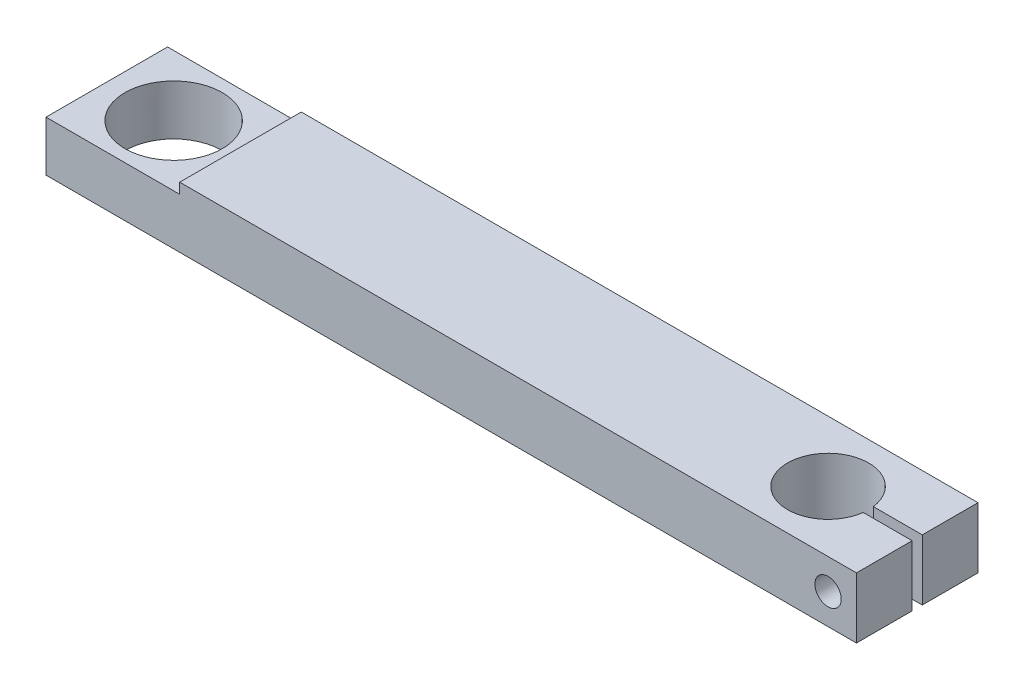
ISO-10303-21;
HEADER;
FILE_DESCRIPTION(('STEP AP214'),'2;1');
FILE_NAME('part.step','',(''),(''),'','','');
FILE_SCHEMA(('AUTOMOTIVE_DESIGN { 1 0 10303 214 1 1 1 1 }'));
ENDSEC;
DATA;
#1=APPLICATION_CONTEXT('core data for automotive mechanical design processes');
#2=APPLICATION_PROTOCOL_DEFINITION('international standard','automotive_design',2000,#1);
#3=PRODUCT_CONTEXT('',#1,'mechanical');
#4=PRODUCT('Part','Part','',(#3));
#5=PRODUCT_RELATED_PRODUCT_CATEGORY('part','',(#4));
#6=PRODUCT_DEFINITION_FORMATION('','',#4);
#7=PRODUCT_DEFINITION_CONTEXT('part definition',#1,'design');
#8=PRODUCT_DEFINITION('design','',#6,#7);
#9=PRODUCT_DEFINITION_SHAPE('','',#8);
#10=(LENGTH_UNIT() NAMED_UNIT(*) SI_UNIT(.MILLI.,.METRE.));
#11=(NAMED_UNIT(*) PLANE_ANGLE_UNIT() SI_UNIT($,.RADIAN.));
#12=(NAMED_UNIT(*) SI_UNIT($,.STERADIAN.) SOLID_ANGLE_UNIT());
#13=UNCERTAINTY_MEASURE_WITH_UNIT(LENGTH_MEASURE(1.E-05),#10,'distance_accuracy_value','');
#14=(GEOMETRIC_REPRESENTATION_CONTEXT(3) GLOBAL_UNCERTAINTY_ASSIGNED_CONTEXT((#13)) GLOBAL_UNIT_ASSIGNED_CONTEXT((#10,
#11,#12)) REPRESENTATION_CONTEXT('',''));
#15=CARTESIAN_POINT('',(0.,0.,0.));
#16=DIRECTION('',(0.,0.,1.));
#17=DIRECTION('',(1.,0.,0.));
#18=AXIS2_PLACEMENT_3D('',#15,#16,#17);
#19=CARTESIAN_POINT('',(78.,15.,0.));
#20=DIRECTION('',(0.,-1.,0.));
#21=DIRECTION('',(0.,0.,-1.));
#22=AXIS2_PLACEMENT_3D('',#19,#20,#21);
#23=CYLINDRICAL_SURFACE('',#22,9.99999999999999);
#24=CARTESIAN_POINT('',(78.,0.,0.));
#25=DIRECTION('',(0.,1.,0.));
#26=DIRECTION('',(0.,0.,1.));
#27=AXIS2_PLACEMENT_3D('',#24,#25,#26);
#28=CIRCLE('',#27,9.99999999999999);
#29=CARTESIAN_POINT('',(87.9215674164922,0.,-1.25));
#30=VERTEX_POINT('',#29);
#31=CARTESIAN_POINT('',(87.9215674164922,0.,1.25));
#32=VERTEX_POINT('',#31);
#33=EDGE_CURVE('E168',#30,#32,#28,.T.);
#34=ORIENTED_EDGE('',*,*,#33,.F.);
#35=DIRECTION('',(0.,-1.,0.));
#36=VECTOR('',#35,1.);
#37=CARTESIAN_POINT('',(87.9215674164922,15.,-1.25));
#38=LINE('',#37,#36);
#39=CARTESIAN_POINT('',(87.9215674164922,15.,-1.25));
#40=VERTEX_POINT('',#39);
#41=EDGE_CURVE('E11',#40,#30,#38,.T.);
#42=ORIENTED_EDGE('',*,*,#41,.F.);
#43=CARTESIAN_POINT('',(78.,15.,0.));
#44=DIRECTION('',(0.,1.,0.));
#45=DIRECTION('',(0.,0.,1.));
#46=AXIS2_PLACEMENT_3D('',#43,#44,#45);
#47=CIRCLE('',#46,9.99999999999999);
#48=CARTESIAN_POINT('',(87.9215674164922,15.,1.25));
#49=VERTEX_POINT('',#48);
#50=EDGE_CURVE('E153',#40,#49,#47,.T.);
#51=ORIENTED_EDGE('',*,*,#50,.T.);
#52=DIRECTION('',(0.,-1.,0.));
#53=VECTOR('',#52,1.);
#54=CARTESIAN_POINT('',(87.9215674164922,15.,1.25));
#55=LINE('',#54,#53);
#56=EDGE_CURVE('E98',#49,#32,#55,.T.);
#57=ORIENTED_EDGE('',*,*,#56,.T.);
#58=EDGE_LOOP('',(#34,#42,#51,#57));
#59=FACE_BOUND('',#58,.T.);
#60=ADVANCED_FACE('F39',(#59),#23,.F.);
#61=CARTESIAN_POINT('',(0.,15.,-1.25));
#62=DIRECTION('',(0.,0.,-1.));
#63=DIRECTION('',(-1.,0.,0.));
#64=AXIS2_PLACEMENT_3D('',#61,#62,#63);
#65=PLANE('',#64);
#66=CARTESIAN_POINT('',(93.,7.5,-1.25));
#67=DIRECTION('',(0.,0.,-1.));
#68=DIRECTION('',(-1.,0.,0.));
#69=AXIS2_PLACEMENT_3D('',#66,#67,#68);
#70=CIRCLE('',#69,3.25000000000001);
#71=CARTESIAN_POINT('',(89.75,7.5,-1.25));
#72=VERTEX_POINT('',#71);
#73=EDGE_CURVE('E164',#72,#72,#70,.T.);
#74=ORIENTED_EDGE('',*,*,#73,.T.);
#75=EDGE_LOOP('',(#74));
#76=FACE_BOUND('',#75,.T.);
#77=DIRECTION('',(1.,0.,0.));
#78=VECTOR('',#77,1.);
#79=CARTESIAN_POINT('',(0.,0.,-1.25));
#80=LINE('',#79,#78);
#81=CARTESIAN_POINT('',(100.,0.,-1.25));
#82=VERTEX_POINT('',#81);
#83=EDGE_CURVE('E273',#30,#82,#80,.T.);
#84=ORIENTED_EDGE('',*,*,#83,.T.);
#85=DIRECTION('',(0.,-1.,0.));
#86=VECTOR('',#85,1.);
#87=CARTESIAN_POINT('',(100.,15.,-1.25));
#88=LINE('',#87,#86);
#89=CARTESIAN_POINT('',(100.,15.,-1.25));
#90=VERTEX_POINT('',#89);
#91=EDGE_CURVE('E48',#90,#82,#88,.T.);
#92=ORIENTED_EDGE('',*,*,#91,.F.);
#93=DIRECTION('',(1.,0.,0.));
#94=VECTOR('',#93,1.);
#95=CARTESIAN_POINT('',(0.,15.,-1.25));
#96=LINE('',#95,#94);
#97=EDGE_CURVE('E147',#40,#90,#96,.T.);
#98=ORIENTED_EDGE('',*,*,#97,.F.);
#99=ORIENTED_EDGE('',*,*,#41,.T.);
#100=EDGE_LOOP('',(#84,#92,#98,#99));
#101=FACE_BOUND('',#100,.T.);
#102=ADVANCED_FACE('F262',(#76,#101),#65,.F.);
#103=CARTESIAN_POINT('',(100.,15.,0.));
#104=DIRECTION('',(1.,0.,0.));
#105=DIRECTION('',(0.,0.,-1.));
#106=AXIS2_PLACEMENT_3D('',#103,#104,#105);
#107=PLANE('',#106);
#108=DIRECTION('',(0.,0.,1.));
#109=VECTOR('',#108,1.);
#110=CARTESIAN_POINT('',(100.,0.,0.));
#111=LINE('',#110,#109);
#112=CARTESIAN_POINT('',(100.,0.,-15.));
#113=VERTEX_POINT('',#112);
#114=EDGE_CURVE('E277',#113,#82,#111,.T.);
#115=ORIENTED_EDGE('',*,*,#114,.F.);
#116=DIRECTION('',(0.,-1.,0.));
#117=VECTOR('',#116,1.);
#118=CARTESIAN_POINT('',(100.,15.,-15.));
#119=LINE('',#118,#117);
#120=CARTESIAN_POINT('',(100.,15.,-15.));
#121=VERTEX_POINT('',#120);
#122=EDGE_CURVE('E230',#121,#113,#119,.T.);
#123=ORIENTED_EDGE('',*,*,#122,.F.);
#124=DIRECTION('',(0.,0.,1.));
#125=VECTOR('',#124,1.);
#126=CARTESIAN_POINT('',(100.,15.,0.));
#127=LINE('',#126,#125);
#128=EDGE_CURVE('E140',#121,#90,#127,.T.);
#129=ORIENTED_EDGE('',*,*,#128,.T.);
#130=ORIENTED_EDGE('',*,*,#91,.T.);
#131=EDGE_LOOP('',(#115,#123,#129,#130));
#132=FACE_BOUND('',#131,.T.);
#133=ADVANCED_FACE('F266',(#132),#107,.T.);
#134=CARTESIAN_POINT('',(0.,15.,-15.));
#135=DIRECTION('',(0.,0.,-1.));
#136=DIRECTION('',(-1.,0.,0.));
#137=AXIS2_PLACEMENT_3D('',#134,#135,#136);
#138=PLANE('',#137);
#139=DIRECTION('',(-1.,0.,0.));
#140=VECTOR('',#139,1.);
#141=CARTESIAN_POINT('',(-100.,12.4,-15.));
#142=LINE('',#141,#140);
#143=CARTESIAN_POINT('',(-67.,12.4,-15.));
#144=VERTEX_POINT('',#143);
#145=CARTESIAN_POINT('',(-100.,12.4,-15.));
#146=VERTEX_POINT('',#145);
#147=EDGE_CURVE('E192',#144,#146,#142,.T.);
#148=ORIENTED_EDGE('',*,*,#147,.F.);
#149=DIRECTION('',(0.,-1.,0.));
#150=VECTOR('',#149,1.);
#151=CARTESIAN_POINT('',(-67.,12.4,-15.));
#152=LINE('',#151,#150);
#153=CARTESIAN_POINT('',(-67.,15.,-15.));
#154=VERTEX_POINT('',#153);
#155=EDGE_CURVE('E196',#154,#144,#152,.T.);
#156=ORIENTED_EDGE('',*,*,#155,.F.);
#157=DIRECTION('',(1.,0.,0.));
#158=VECTOR('',#157,1.);
#159=CARTESIAN_POINT('',(0.,15.,-15.));
#160=LINE('',#159,#158);
#161=EDGE_CURVE('E123',#154,#121,#160,.T.);
#162=ORIENTED_EDGE('',*,*,#161,.T.);
#163=ORIENTED_EDGE('',*,*,#122,.T.);
#164=DIRECTION('',(1.,0.,0.));
#165=VECTOR('',#164,1.);
#166=CARTESIAN_POINT('',(0.,0.,-15.));
#167=LINE('',#166,#165);
#168=CARTESIAN_POINT('',(-100.,0.,-15.));
#169=VERTEX_POINT('',#168);
#170=EDGE_CURVE('E225',#169,#113,#167,.T.);
#171=ORIENTED_EDGE('',*,*,#170,.F.);
#172=DIRECTION('',(0.,-1.,0.));
#173=VECTOR('',#172,1.);
#174=CARTESIAN_POINT('',(-100.,15.,-15.));
#175=LINE('',#174,#173);
#176=EDGE_CURVE('E223',#146,#169,#175,.T.);
#177=ORIENTED_EDGE('',*,*,#176,.F.);
#178=EDGE_LOOP('',(#148,#156,#162,#163,#171,#177));
#179=FACE_BOUND('',#178,.T.);
#180=CARTESIAN_POINT('',(93.,7.5,-15.));
#181=DIRECTION('',(0.,0.,-1.));
#182=DIRECTION('',(-1.,0.,0.));
#183=AXIS2_PLACEMENT_3D('',#180,#181,#182);
#184=CIRCLE('',#183,5.25);
#185=CARTESIAN_POINT('',(87.75,7.5,-15.));
#186=VERTEX_POINT('',#185);
#187=EDGE_CURVE('E159',#186,#186,#184,.T.);
#188=ORIENTED_EDGE('',*,*,#187,.F.);
#189=EDGE_LOOP('',(#188));
#190=FACE_BOUND('',#189,.T.);
#191=ADVANCED_FACE('F220',(#179,#190),#138,.T.);
#192=CARTESIAN_POINT('',(-100.,15.,0.));
#193=DIRECTION('',(1.,0.,0.));
#194=DIRECTION('',(0.,0.,-1.));
#195=AXIS2_PLACEMENT_3D('',#192,#193,#194);
#196=PLANE('',#195);
#197=DIRECTION('',(0.,-1.,0.));
#198=VECTOR('',#197,1.);
#199=CARTESIAN_POINT('',(-100.,15.,15.));
#200=LINE('',#199,#198);
#201=CARTESIAN_POINT('',(-100.,12.4,15.));
#202=VERTEX_POINT('',#201);
#203=CARTESIAN_POINT('',(-100.,0.,15.));
#204=VERTEX_POINT('',#203);
#205=EDGE_CURVE('E134',#202,#204,#200,.T.);
#206=ORIENTED_EDGE('',*,*,#205,.F.);
#207=DIRECTION('',(0.,0.,-1.));
#208=VECTOR('',#207,1.);
#209=CARTESIAN_POINT('',(-100.,12.4,15.));
#210=LINE('',#209,#208);
#211=EDGE_CURVE('E188',#202,#146,#210,.T.);
#212=ORIENTED_EDGE('',*,*,#211,.T.);
#213=ORIENTED_EDGE('',*,*,#176,.T.);
#214=DIRECTION('',(0.,0.,1.));
#215=VECTOR('',#214,1.);
#216=CARTESIAN_POINT('',(-100.,0.,0.));
#217=LINE('',#216,#215);
#218=EDGE_CURVE('E286',#169,#204,#217,.T.);
#219=ORIENTED_EDGE('',*,*,#218,.T.);
#220=EDGE_LOOP('',(#206,#212,#213,#219));
#221=FACE_BOUND('',#220,.T.);
#222=ADVANCED_FACE('F303',(#221),#196,.F.);
#223=CARTESIAN_POINT('',(0.,15.,15.));
#224=DIRECTION('',(0.,0.,-1.));
#225=DIRECTION('',(-1.,0.,0.));
#226=AXIS2_PLACEMENT_3D('',#223,#224,#225);
#227=PLANE('',#226);
#228=CARTESIAN_POINT('',(93.,7.5,15.));
#229=DIRECTION('',(0.,0.,-1.));
#230=DIRECTION('',(-1.,0.,0.));
#231=AXIS2_PLACEMENT_3D('',#228,#229,#230);
#232=CIRCLE('',#231,3.25000000000001);
#233=CARTESIAN_POINT('',(89.75,7.5,15.));
#234=VERTEX_POINT('',#233);
#235=EDGE_CURVE('E177',#234,#234,#232,.T.);
#236=ORIENTED_EDGE('',*,*,#235,.T.);
#237=EDGE_LOOP('',(#236));
#238=FACE_BOUND('',#237,.T.);
#239=DIRECTION('',(0.,-1.,0.));
#240=VECTOR('',#239,1.);
#241=CARTESIAN_POINT('',(-67.,12.4,15.));
#242=LINE('',#241,#240);
#243=CARTESIAN_POINT('',(-67.,15.,15.));
#244=VERTEX_POINT('',#243);
#245=CARTESIAN_POINT('',(-67.,12.4,15.));
#246=VERTEX_POINT('',#245);
#247=EDGE_CURVE('E56',#244,#246,#242,.T.);
#248=ORIENTED_EDGE('',*,*,#247,.T.);
#249=DIRECTION('',(-1.,0.,0.));
#250=VECTOR('',#249,1.);
#251=CARTESIAN_POINT('',(-100.,12.4,15.));
#252=LINE('',#251,#250);
#253=EDGE_CURVE('E184',#246,#202,#252,.T.);
#254=ORIENTED_EDGE('',*,*,#253,.T.);
#255=ORIENTED_EDGE('',*,*,#205,.T.);
#256=DIRECTION('',(1.,0.,0.));
#257=VECTOR('',#256,1.);
#258=CARTESIAN_POINT('',(0.,0.,15.));
#259=LINE('',#258,#257);
#260=CARTESIAN_POINT('',(100.,0.,15.));
#261=VERTEX_POINT('',#260);
#262=EDGE_CURVE('E129',#204,#261,#259,.T.);
#263=ORIENTED_EDGE('',*,*,#262,.T.);
#264=DIRECTION('',(0.,-1.,0.));
#265=VECTOR('',#264,1.);
#266=CARTESIAN_POINT('',(100.,15.,15.));
#267=LINE('',#266,#265);
#268=CARTESIAN_POINT('',(100.,15.,15.));
#269=VERTEX_POINT('',#268);
#270=EDGE_CURVE('E126',#269,#261,#267,.T.);
#271=ORIENTED_EDGE('',*,*,#270,.F.);
#272=DIRECTION('',(1.,0.,0.));
#273=VECTOR('',#272,1.);
#274=CARTESIAN_POINT('',(0.,15.,15.));
#275=LINE('',#274,#273);
#276=EDGE_CURVE('E114',#244,#269,#275,.T.);
#277=ORIENTED_EDGE('',*,*,#276,.F.);
#278=EDGE_LOOP('',(#248,#254,#255,#263,#271,#277));
#279=FACE_BOUND('',#278,.T.);
#280=ADVANCED_FACE('F127',(#238,#279),#227,.F.);
#281=CARTESIAN_POINT('',(100.,0.,1.25));
#282=VERTEX_POINT('',#281);
#283=EDGE_CURVE('E283',#282,#261,#111,.T.);
#284=ORIENTED_EDGE('',*,*,#283,.F.);
#285=DIRECTION('',(0.,-1.,0.));
#286=VECTOR('',#285,1.);
#287=CARTESIAN_POINT('',(100.,15.,1.25));
#288=LINE('',#287,#286);
#289=CARTESIAN_POINT('',(100.,15.,1.25));
#290=VERTEX_POINT('',#289);
#291=EDGE_CURVE('E135',#290,#282,#288,.T.);
#292=ORIENTED_EDGE('',*,*,#291,.F.);
#293=EDGE_CURVE('E118',#290,#269,#127,.T.);
#294=ORIENTED_EDGE('',*,*,#293,.T.);
#295=ORIENTED_EDGE('',*,*,#270,.T.);
#296=EDGE_LOOP('',(#284,#292,#294,#295));
#297=FACE_BOUND('',#296,.T.);
#298=ADVANCED_FACE('F137',(#297),#107,.T.);
#299=CARTESIAN_POINT('',(0.,15.,1.25000000000001));
#300=DIRECTION('',(0.,0.,1.));
#301=DIRECTION('',(1.,0.,0.));
#302=AXIS2_PLACEMENT_3D('',#299,#300,#301);
#303=PLANE('',#302);
#304=CARTESIAN_POINT('',(93.,7.5,1.25));
#305=DIRECTION('',(0.,0.,1.));
#306=DIRECTION('',(1.,0.,0.));
#307=AXIS2_PLACEMENT_3D('',#304,#305,#306);
#308=CIRCLE('',#307,3.25000000000001);
#309=CARTESIAN_POINT('',(96.25,7.5,1.25));
#310=VERTEX_POINT('',#309);
#311=EDGE_CURVE('E172',#310,#310,#308,.T.);
#312=ORIENTED_EDGE('',*,*,#311,.T.);
#313=EDGE_LOOP('',(#312));
#314=FACE_BOUND('',#313,.T.);
#315=DIRECTION('',(-1.,0.,0.));
#316=VECTOR('',#315,1.);
#317=CARTESIAN_POINT('',(0.,0.,1.25000000000001));
#318=LINE('',#317,#316);
#319=EDGE_CURVE('E291',#282,#32,#318,.T.);
#320=ORIENTED_EDGE('',*,*,#319,.T.);
#321=ORIENTED_EDGE('',*,*,#56,.F.);
#322=DIRECTION('',(-1.,0.,0.));
#323=VECTOR('',#322,1.);
#324=CARTESIAN_POINT('',(0.,15.,1.25000000000001));
#325=LINE('',#324,#323);
#326=EDGE_CURVE('E65',#290,#49,#325,.T.);
#327=ORIENTED_EDGE('',*,*,#326,.F.);
#328=ORIENTED_EDGE('',*,*,#291,.T.);
#329=EDGE_LOOP('',(#320,#321,#327,#328));
#330=FACE_BOUND('',#329,.T.);
#331=ADVANCED_FACE('F242',(#314,#330),#303,.F.);
#332=CARTESIAN_POINT('',(-83.5,15.,0.));
#333=DIRECTION('',(0.,-1.,0.));
#334=DIRECTION('',(0.,0.,-1.));
#335=AXIS2_PLACEMENT_3D('',#332,#333,#334);
#336=CYLINDRICAL_SURFACE('',#335,12.);
#337=CARTESIAN_POINT('',(-83.5,12.4,0.));
#338=DIRECTION('',(0.,-1.,0.));
#339=DIRECTION('',(1.,0.,0.));
#340=AXIS2_PLACEMENT_3D('',#337,#338,#339);
#341=CIRCLE('',#340,12.);
#342=CARTESIAN_POINT('',(-71.5,12.4,0.));
#343=VERTEX_POINT('',#342);
#344=EDGE_CURVE('E42',#343,#343,#341,.T.);
#345=ORIENTED_EDGE('',*,*,#344,.F.);
#346=EDGE_LOOP('',(#345));
#347=FACE_BOUND('',#346,.T.);
#348=CARTESIAN_POINT('',(-83.5,0.,0.));
#349=DIRECTION('',(0.,1.,0.));
#350=DIRECTION('',(0.,0.,1.));
#351=AXIS2_PLACEMENT_3D('',#348,#349,#350);
#352=CIRCLE('',#351,12.);
#353=CARTESIAN_POINT('',(-83.5,0.,12.));
#354=VERTEX_POINT('',#353);
#355=EDGE_CURVE('E156',#354,#354,#352,.T.);
#356=ORIENTED_EDGE('',*,*,#355,.F.);
#357=EDGE_LOOP('',(#356));
#358=FACE_BOUND('',#357,.T.);
#359=ADVANCED_FACE('F318',(#347,#358),#336,.F.);
#360=CARTESIAN_POINT('',(0.,15.,0.));
#361=DIRECTION('',(0.,1.,0.));
#362=DIRECTION('',(0.,0.,1.));
#363=AXIS2_PLACEMENT_3D('',#360,#361,#362);
#364=PLANE('',#363);
#365=DIRECTION('',(0.,0.,-1.));
#366=VECTOR('',#365,1.);
#367=CARTESIAN_POINT('',(-67.,15.,15.));
#368=LINE('',#367,#366);
#369=EDGE_CURVE('E120',#244,#154,#368,.T.);
#370=ORIENTED_EDGE('',*,*,#369,.F.);
#371=ORIENTED_EDGE('',*,*,#276,.T.);
#372=ORIENTED_EDGE('',*,*,#293,.F.);
#373=ORIENTED_EDGE('',*,*,#326,.T.);
#374=ORIENTED_EDGE('',*,*,#50,.F.);
#375=ORIENTED_EDGE('',*,*,#97,.T.);
#376=ORIENTED_EDGE('',*,*,#128,.F.);
#377=ORIENTED_EDGE('',*,*,#161,.F.);
#378=EDGE_LOOP('',(#370,#371,#372,#373,#374,#375,#376,#377));
#379=FACE_BOUND('',#378,.T.);
#380=ADVANCED_FACE('F116',(#379),#364,.T.);
#381=CARTESIAN_POINT('',(0.,0.,0.));
#382=DIRECTION('',(0.,1.,0.));
#383=DIRECTION('',(0.,0.,1.));
#384=AXIS2_PLACEMENT_3D('',#381,#382,#383);
#385=PLANE('',#384);
#386=ORIENTED_EDGE('',*,*,#33,.T.);
#387=ORIENTED_EDGE('',*,*,#319,.F.);
#388=ORIENTED_EDGE('',*,*,#283,.T.);
#389=ORIENTED_EDGE('',*,*,#262,.F.);
#390=ORIENTED_EDGE('',*,*,#218,.F.);
#391=ORIENTED_EDGE('',*,*,#170,.T.);
#392=ORIENTED_EDGE('',*,*,#114,.T.);
#393=ORIENTED_EDGE('',*,*,#83,.F.);
#394=EDGE_LOOP('',(#386,#387,#388,#389,#390,#391,#392,#393));
#395=FACE_BOUND('',#394,.T.);
#396=ORIENTED_EDGE('',*,*,#355,.T.);
#397=EDGE_LOOP('',(#396));
#398=FACE_BOUND('',#397,.T.);
#399=ADVANCED_FACE('F300',(#395,#398),#385,.F.);
#400=CARTESIAN_POINT('',(93.,7.5,-8.));
#401=DIRECTION('',(0.,0.,-1.));
#402=DIRECTION('',(-1.,0.,0.));
#403=AXIS2_PLACEMENT_3D('',#400,#401,#402);
#404=CYLINDRICAL_SURFACE('',#403,5.25);
#405=CARTESIAN_POINT('',(93.,7.5,-8.));
#406=DIRECTION('',(0.,0.,-1.));
#407=DIRECTION('',(-1.,0.,0.));
#408=AXIS2_PLACEMENT_3D('',#405,#406,#407);
#409=CIRCLE('',#408,5.25);
#410=CARTESIAN_POINT('',(87.75,7.5,-8.));
#411=VERTEX_POINT('',#410);
#412=EDGE_CURVE('E163',#411,#411,#409,.T.);
#413=ORIENTED_EDGE('',*,*,#412,.F.);
#414=EDGE_LOOP('',(#413));
#415=FACE_BOUND('',#414,.T.);
#416=ORIENTED_EDGE('',*,*,#187,.T.);
#417=EDGE_LOOP('',(#416));
#418=FACE_BOUND('',#417,.T.);
#419=ADVANCED_FACE('F256',(#415,#418),#404,.F.);
#420=CARTESIAN_POINT('',(93.,7.5,-8.));
#421=DIRECTION('',(0.,0.,-1.));
#422=DIRECTION('',(-1.,0.,0.));
#423=AXIS2_PLACEMENT_3D('',#420,#421,#422);
#424=PLANE('',#423);
#425=CARTESIAN_POINT('',(93.,7.5,-8.));
#426=DIRECTION('',(0.,0.,-1.));
#427=DIRECTION('',(-1.,0.,0.));
#428=AXIS2_PLACEMENT_3D('',#425,#426,#427);
#429=CIRCLE('',#428,3.25000000000001);
#430=CARTESIAN_POINT('',(89.75,7.5,-8.));
#431=VERTEX_POINT('',#430);
#432=EDGE_CURVE('E173',#431,#431,#429,.T.);
#433=ORIENTED_EDGE('',*,*,#432,.F.);
#434=EDGE_LOOP('',(#433));
#435=FACE_BOUND('',#434,.T.);
#436=ORIENTED_EDGE('',*,*,#412,.T.);
#437=EDGE_LOOP('',(#436));
#438=FACE_BOUND('',#437,.T.);
#439=ADVANCED_FACE('F248',(#435,#438),#424,.T.);
#440=CARTESIAN_POINT('',(93.,7.5,15.));
#441=DIRECTION('',(0.,0.,-1.));
#442=DIRECTION('',(-1.,0.,0.));
#443=AXIS2_PLACEMENT_3D('',#440,#441,#442);
#444=CYLINDRICAL_SURFACE('',#443,3.25000000000001);
#445=ORIENTED_EDGE('',*,*,#235,.F.);
#446=EDGE_LOOP('',(#445));
#447=FACE_BOUND('',#446,.T.);
#448=ORIENTED_EDGE('',*,*,#311,.F.);
#449=EDGE_LOOP('',(#448));
#450=FACE_BOUND('',#449,.T.);
#451=ADVANCED_FACE('F245',(#447,#450),#444,.F.);
#452=ORIENTED_EDGE('',*,*,#432,.T.);
#453=EDGE_LOOP('',(#452));
#454=FACE_BOUND('',#453,.T.);
#455=ORIENTED_EDGE('',*,*,#73,.F.);
#456=EDGE_LOOP('',(#455));
#457=FACE_BOUND('',#456,.T.);
#458=ADVANCED_FACE('F247',(#454,#457),#444,.F.);
#459=CARTESIAN_POINT('',(-100.,12.4,15.));
#460=DIRECTION('',(0.,-1.,0.));
#461=DIRECTION('',(1.,0.,0.));
#462=AXIS2_PLACEMENT_3D('',#459,#460,#461);
#463=PLANE('',#462);
#464=ORIENTED_EDGE('',*,*,#344,.T.);
#465=EDGE_LOOP('',(#464));
#466=FACE_BOUND('',#465,.T.);
#467=ORIENTED_EDGE('',*,*,#147,.T.);
#468=ORIENTED_EDGE('',*,*,#211,.F.);
#469=ORIENTED_EDGE('',*,*,#253,.F.);
#470=DIRECTION('',(0.,0.,-1.));
#471=VECTOR('',#470,1.);
#472=CARTESIAN_POINT('',(-67.,12.4,15.));
#473=LINE('',#472,#471);
#474=EDGE_CURVE('E183',#246,#144,#473,.T.);
#475=ORIENTED_EDGE('',*,*,#474,.T.);
#476=EDGE_LOOP('',(#467,#468,#469,#475));
#477=FACE_BOUND('',#476,.T.);
#478=ADVANCED_FACE('F214',(#466,#477),#463,.F.);
#479=CARTESIAN_POINT('',(-67.,12.4,15.));
#480=DIRECTION('',(1.,0.,0.));
#481=DIRECTION('',(0.,0.,-1.));
#482=AXIS2_PLACEMENT_3D('',#479,#480,#481);
#483=PLANE('',#482);
#484=ORIENTED_EDGE('',*,*,#155,.T.);
#485=ORIENTED_EDGE('',*,*,#474,.F.);
#486=ORIENTED_EDGE('',*,*,#247,.F.);
#487=ORIENTED_EDGE('',*,*,#369,.T.);
#488=EDGE_LOOP('',(#484,#485,#486,#487));
#489=FACE_BOUND('',#488,.T.);
#490=ADVANCED_FACE('F217',(#489),#483,.F.);
#491=CLOSED_SHELL('',(#60,#102,#133,#191,#222,#280,#298,#331,#359,#380,#399,#419,#439,#451,#458,
#478,#490));
#492=MANIFOLD_SOLID_BREP('B2',#491);
#493=ADVANCED_BREP_SHAPE_REPRESENTATION('',(#18,#492),#14);
#494=SHAPE_DEFINITION_REPRESENTATION(#9,#493);
ENDSEC;
END-ISO-10303-21;
